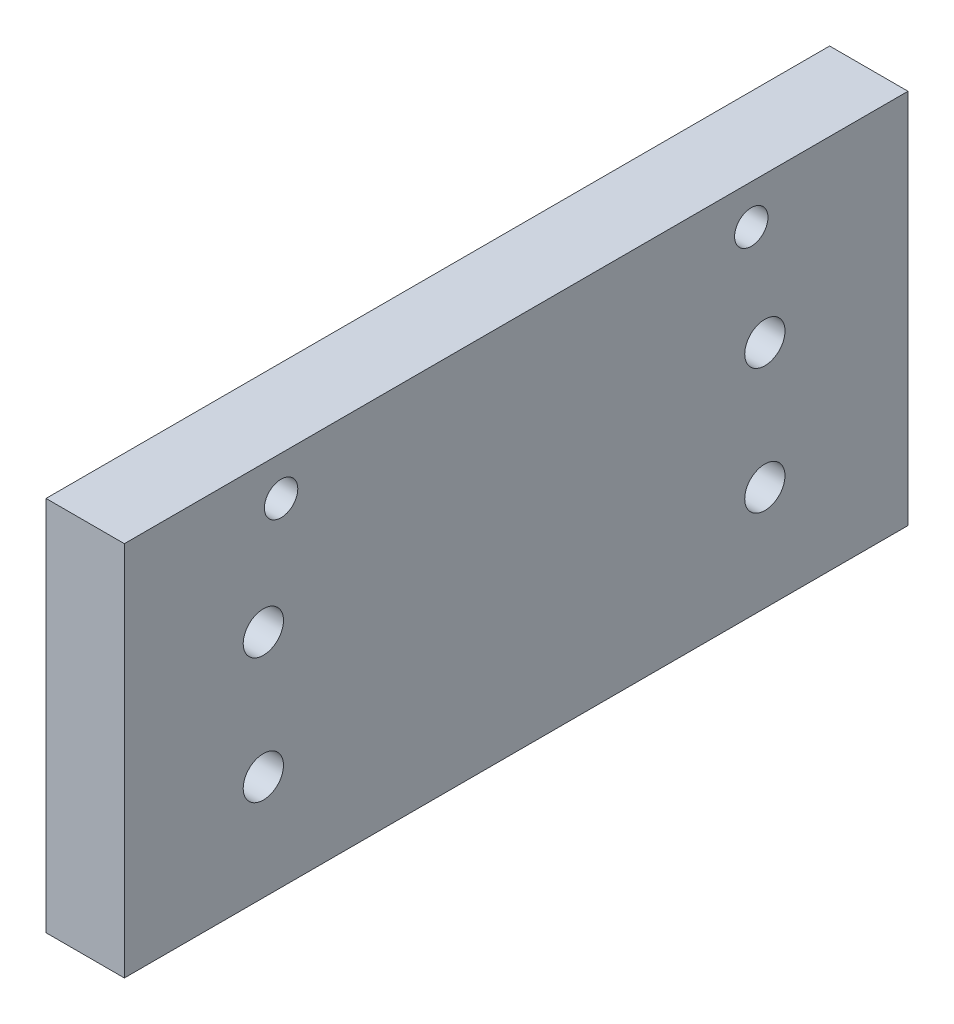
ISO-10303-21;
HEADER;
FILE_DESCRIPTION(('STEP AP214'),'2;1');
FILE_NAME('part.step','',(''),(''),'','','');
FILE_SCHEMA(('AUTOMOTIVE_DESIGN { 1 0 10303 214 1 1 1 1 }'));
ENDSEC;
DATA;
#1=APPLICATION_CONTEXT('core data for automotive mechanical design processes');
#2=APPLICATION_PROTOCOL_DEFINITION('international standard','automotive_design',2000,#1);
#3=PRODUCT_CONTEXT('',#1,'mechanical');
#4=PRODUCT('Part','Part','',(#3));
#5=PRODUCT_RELATED_PRODUCT_CATEGORY('part','',(#4));
#6=PRODUCT_DEFINITION_FORMATION('','',#4);
#7=PRODUCT_DEFINITION_CONTEXT('part definition',#1,'design');
#8=PRODUCT_DEFINITION('design','',#6,#7);
#9=PRODUCT_DEFINITION_SHAPE('','',#8);
#10=(LENGTH_UNIT() NAMED_UNIT(*) SI_UNIT(.MILLI.,.METRE.));
#11=(NAMED_UNIT(*) PLANE_ANGLE_UNIT() SI_UNIT($,.RADIAN.));
#12=(NAMED_UNIT(*) SI_UNIT($,.STERADIAN.) SOLID_ANGLE_UNIT());
#13=UNCERTAINTY_MEASURE_WITH_UNIT(LENGTH_MEASURE(1.E-05),#10,'distance_accuracy_value','');
#14=(GEOMETRIC_REPRESENTATION_CONTEXT(3) GLOBAL_UNCERTAINTY_ASSIGNED_CONTEXT((#13)) GLOBAL_UNIT_ASSIGNED_CONTEXT((#10,
#11,#12)) REPRESENTATION_CONTEXT('',''));
#15=CARTESIAN_POINT('',(0.,0.,0.));
#16=DIRECTION('',(0.,0.,1.));
#17=DIRECTION('',(1.,0.,0.));
#18=AXIS2_PLACEMENT_3D('',#15,#16,#17);
#19=CARTESIAN_POINT('',(0.,4.96112837408402,60.2648722985479));
#20=DIRECTION('',(1.,0.,0.));
#21=DIRECTION('',(0.,0.,-1.));
#22=AXIS2_PLACEMENT_3D('',#19,#20,#21);
#23=PLANE('',#22);
#24=CARTESIAN_POINT('',(0.,23.6086809904208,49.003470458459));
#25=DIRECTION('',(-1.,0.,0.));
#26=DIRECTION('',(0.,0.,1.));
#27=AXIS2_PLACEMENT_3D('',#24,#25,#26);
#28=CIRCLE('',#27,1.63194999999999);
#29=CARTESIAN_POINT('',(0.,23.6086809904208,50.635420458459));
#30=VERTEX_POINT('',#29);
#31=EDGE_CURVE('E218',#30,#30,#28,.T.);
#32=ORIENTED_EDGE('',*,*,#31,.F.);
#33=EDGE_LOOP('',(#32));
#34=FACE_BOUND('',#33,.T.);
#35=CARTESIAN_POINT('',(0.,23.6086809904208,8.36347045845898));
#36=DIRECTION('',(-1.,0.,0.));
#37=DIRECTION('',(0.,0.,1.));
#38=AXIS2_PLACEMENT_3D('',#35,#36,#37);
#39=CIRCLE('',#38,1.63194999999999);
#40=CARTESIAN_POINT('',(0.,23.6086809904208,9.99542045845897));
#41=VERTEX_POINT('',#40);
#42=EDGE_CURVE('E114',#41,#41,#39,.T.);
#43=ORIENTED_EDGE('',*,*,#42,.F.);
#44=EDGE_LOOP('',(#43));
#45=FACE_BOUND('',#44,.T.);
#46=CARTESIAN_POINT('',(0.,32.266128374084,47.5648722985479));
#47=DIRECTION('',(-1.,0.,0.));
#48=DIRECTION('',(0.,0.,1.));
#49=AXIS2_PLACEMENT_3D('',#46,#47,#48);
#50=CIRCLE('',#49,1.98755);
#51=CARTESIAN_POINT('',(0.,32.266128374084,49.5524222985479));
#52=VERTEX_POINT('',#51);
#53=EDGE_CURVE('E198',#52,#52,#50,.T.);
#54=ORIENTED_EDGE('',*,*,#53,.F.);
#55=EDGE_LOOP('',(#54));
#56=FACE_BOUND('',#55,.T.);
#57=DIRECTION('',(0.,-1.,0.));
#58=VECTOR('',#57,1.);
#59=CARTESIAN_POINT('',(0.,35.441128374084,60.2648722985479));
#60=LINE('',#59,#58);
#61=CARTESIAN_POINT('',(0.,35.441128374084,60.2648722985479));
#62=VERTEX_POINT('',#61);
#63=CARTESIAN_POINT('',(0.,4.96112837408402,60.2648722985479));
#64=VERTEX_POINT('',#63);
#65=EDGE_CURVE('E99',#62,#64,#60,.T.);
#66=ORIENTED_EDGE('',*,*,#65,.F.);
#67=DIRECTION('',(0.,0.,1.));
#68=VECTOR('',#67,1.);
#69=CARTESIAN_POINT('',(0.,35.441128374084,60.2648722985479));
#70=LINE('',#69,#68);
#71=CARTESIAN_POINT('',(0.,35.441128374084,-3.23512770145205));
#72=VERTEX_POINT('',#71);
#73=EDGE_CURVE('E70',#72,#62,#70,.T.);
#74=ORIENTED_EDGE('',*,*,#73,.F.);
#75=DIRECTION('',(0.,1.,0.));
#76=VECTOR('',#75,1.);
#77=CARTESIAN_POINT('',(0.,35.441128374084,-3.23512770145205));
#78=LINE('',#77,#76);
#79=CARTESIAN_POINT('',(0.,4.96112837408402,-3.23512770145207));
#80=VERTEX_POINT('',#79);
#81=EDGE_CURVE('E64',#80,#72,#78,.T.);
#82=ORIENTED_EDGE('',*,*,#81,.F.);
#83=DIRECTION('',(0.,0.,-1.));
#84=VECTOR('',#83,1.);
#85=CARTESIAN_POINT('',(0.,4.96112837408402,60.2648722985479));
#86=LINE('',#85,#84);
#87=EDGE_CURVE('E89',#64,#80,#86,.T.);
#88=ORIENTED_EDGE('',*,*,#87,.F.);
#89=EDGE_LOOP('',(#66,#74,#82,#88));
#90=FACE_BOUND('',#89,.T.);
#91=CARTESIAN_POINT('',(0.,32.266128374084,9.46487229854794));
#92=DIRECTION('',(-1.,0.,0.));
#93=DIRECTION('',(0.,0.,1.));
#94=AXIS2_PLACEMENT_3D('',#91,#92,#93);
#95=CIRCLE('',#94,1.98755);
#96=CARTESIAN_POINT('',(0.,32.266128374084,11.4524222985479));
#97=VERTEX_POINT('',#96);
#98=EDGE_CURVE('E113',#97,#97,#95,.T.);
#99=ORIENTED_EDGE('',*,*,#98,.F.);
#100=EDGE_LOOP('',(#99));
#101=FACE_BOUND('',#100,.T.);
#102=CARTESIAN_POINT('',(0.,13.4486809904208,8.36347045845897));
#103=DIRECTION('',(-1.,0.,0.));
#104=DIRECTION('',(0.,0.,1.));
#105=AXIS2_PLACEMENT_3D('',#102,#103,#104);
#106=CIRCLE('',#105,1.63194999999999);
#107=CARTESIAN_POINT('',(0.,13.4486809904208,9.99542045845896));
#108=VERTEX_POINT('',#107);
#109=EDGE_CURVE('E117',#108,#108,#106,.T.);
#110=ORIENTED_EDGE('',*,*,#109,.F.);
#111=EDGE_LOOP('',(#110));
#112=FACE_BOUND('',#111,.T.);
#113=CARTESIAN_POINT('',(0.,13.4486809904208,49.003470458459));
#114=DIRECTION('',(-1.,0.,0.));
#115=DIRECTION('',(0.,0.,1.));
#116=AXIS2_PLACEMENT_3D('',#113,#114,#115);
#117=CIRCLE('',#116,1.63194999999999);
#118=CARTESIAN_POINT('',(0.,13.4486809904208,50.635420458459));
#119=VERTEX_POINT('',#118);
#120=EDGE_CURVE('E11',#119,#119,#117,.T.);
#121=ORIENTED_EDGE('',*,*,#120,.F.);
#122=EDGE_LOOP('',(#121));
#123=FACE_BOUND('',#122,.T.);
#124=ADVANCED_FACE('F30',(#34,#45,#56,#90,#101,#112,#123),#23,.F.);
#125=CARTESIAN_POINT('',(6.35,35.441128374084,60.2648722985479));
#126=DIRECTION('',(0.,0.,-1.));
#127=DIRECTION('',(0.,1.,0.));
#128=AXIS2_PLACEMENT_3D('',#125,#126,#127);
#129=PLANE('',#128);
#130=ORIENTED_EDGE('',*,*,#65,.T.);
#131=DIRECTION('',(-1.,0.,0.));
#132=VECTOR('',#131,1.);
#133=CARTESIAN_POINT('',(6.35,4.96112837408402,60.2648722985479));
#134=LINE('',#133,#132);
#135=CARTESIAN_POINT('',(6.35,4.96112837408402,60.2648722985479));
#136=VERTEX_POINT('',#135);
#137=EDGE_CURVE('E90',#136,#64,#134,.T.);
#138=ORIENTED_EDGE('',*,*,#137,.F.);
#139=DIRECTION('',(0.,-1.,0.));
#140=VECTOR('',#139,1.);
#141=CARTESIAN_POINT('',(6.35,35.441128374084,60.2648722985479));
#142=LINE('',#141,#140);
#143=CARTESIAN_POINT('',(6.35,35.441128374084,60.2648722985479));
#144=VERTEX_POINT('',#143);
#145=EDGE_CURVE('E84',#144,#136,#142,.T.);
#146=ORIENTED_EDGE('',*,*,#145,.F.);
#147=DIRECTION('',(-1.,0.,0.));
#148=VECTOR('',#147,1.);
#149=CARTESIAN_POINT('',(6.35,35.441128374084,60.2648722985479));
#150=LINE('',#149,#148);
#151=EDGE_CURVE('E95',#144,#62,#150,.T.);
#152=ORIENTED_EDGE('',*,*,#151,.T.);
#153=EDGE_LOOP('',(#130,#138,#146,#152));
#154=FACE_BOUND('',#153,.T.);
#155=ADVANCED_FACE('F142',(#154),#129,.F.);
#156=CARTESIAN_POINT('',(6.35,4.96112837408402,60.2648722985479));
#157=DIRECTION('',(0.,1.,0.));
#158=DIRECTION('',(0.,0.,1.));
#159=AXIS2_PLACEMENT_3D('',#156,#157,#158);
#160=PLANE('',#159);
#161=ORIENTED_EDGE('',*,*,#87,.T.);
#162=DIRECTION('',(-1.,0.,0.));
#163=VECTOR('',#162,1.);
#164=CARTESIAN_POINT('',(6.35,4.96112837408402,-3.23512770145207));
#165=LINE('',#164,#163);
#166=CARTESIAN_POINT('',(6.35,4.96112837408402,-3.23512770145207));
#167=VERTEX_POINT('',#166);
#168=EDGE_CURVE('E87',#167,#80,#165,.T.);
#169=ORIENTED_EDGE('',*,*,#168,.F.);
#170=DIRECTION('',(0.,0.,-1.));
#171=VECTOR('',#170,1.);
#172=CARTESIAN_POINT('',(6.35,4.96112837408402,60.2648722985479));
#173=LINE('',#172,#171);
#174=EDGE_CURVE('E78',#136,#167,#173,.T.);
#175=ORIENTED_EDGE('',*,*,#174,.F.);
#176=ORIENTED_EDGE('',*,*,#137,.T.);
#177=EDGE_LOOP('',(#161,#169,#175,#176));
#178=FACE_BOUND('',#177,.T.);
#179=ADVANCED_FACE('F88',(#178),#160,.F.);
#180=CARTESIAN_POINT('',(6.35,35.441128374084,-3.23512770145205));
#181=DIRECTION('',(0.,0.,1.));
#182=DIRECTION('',(0.,-1.,0.));
#183=AXIS2_PLACEMENT_3D('',#180,#181,#182);
#184=PLANE('',#183);
#185=ORIENTED_EDGE('',*,*,#81,.T.);
#186=DIRECTION('',(-1.,0.,0.));
#187=VECTOR('',#186,1.);
#188=CARTESIAN_POINT('',(6.35,35.441128374084,-3.23512770145205));
#189=LINE('',#188,#187);
#190=CARTESIAN_POINT('',(6.35,35.441128374084,-3.23512770145205));
#191=VERTEX_POINT('',#190);
#192=EDGE_CURVE('E91',#191,#72,#189,.T.);
#193=ORIENTED_EDGE('',*,*,#192,.F.);
#194=DIRECTION('',(0.,1.,0.));
#195=VECTOR('',#194,1.);
#196=CARTESIAN_POINT('',(6.35,35.441128374084,-3.23512770145205));
#197=LINE('',#196,#195);
#198=EDGE_CURVE('E82',#167,#191,#197,.T.);
#199=ORIENTED_EDGE('',*,*,#198,.F.);
#200=ORIENTED_EDGE('',*,*,#168,.T.);
#201=EDGE_LOOP('',(#185,#193,#199,#200));
#202=FACE_BOUND('',#201,.T.);
#203=ADVANCED_FACE('F93',(#202),#184,.F.);
#204=CARTESIAN_POINT('',(6.35,35.441128374084,60.2648722985479));
#205=DIRECTION('',(0.,-1.,0.));
#206=DIRECTION('',(0.,0.,-1.));
#207=AXIS2_PLACEMENT_3D('',#204,#205,#206);
#208=PLANE('',#207);
#209=ORIENTED_EDGE('',*,*,#73,.T.);
#210=ORIENTED_EDGE('',*,*,#151,.F.);
#211=DIRECTION('',(0.,0.,1.));
#212=VECTOR('',#211,1.);
#213=CARTESIAN_POINT('',(6.35,35.441128374084,60.2648722985479));
#214=LINE('',#213,#212);
#215=EDGE_CURVE('E47',#191,#144,#214,.T.);
#216=ORIENTED_EDGE('',*,*,#215,.F.);
#217=ORIENTED_EDGE('',*,*,#192,.T.);
#218=EDGE_LOOP('',(#209,#210,#216,#217));
#219=FACE_BOUND('',#218,.T.);
#220=ADVANCED_FACE('F126',(#219),#208,.F.);
#221=CARTESIAN_POINT('',(6.35,4.96112837408402,60.2648722985479));
#222=DIRECTION('',(1.,0.,0.));
#223=DIRECTION('',(0.,0.,-1.));
#224=AXIS2_PLACEMENT_3D('',#221,#222,#223);
#225=PLANE('',#224);
#226=CARTESIAN_POINT('',(6.35,23.6086809904208,49.003470458459));
#227=DIRECTION('',(1.,0.,0.));
#228=DIRECTION('',(0.,0.,-1.));
#229=AXIS2_PLACEMENT_3D('',#226,#227,#228);
#230=CIRCLE('',#229,1.63194999999999);
#231=CARTESIAN_POINT('',(6.35,23.6086809904208,47.371520458459));
#232=VERTEX_POINT('',#231);
#233=EDGE_CURVE('E221',#232,#232,#230,.T.);
#234=ORIENTED_EDGE('',*,*,#233,.F.);
#235=EDGE_LOOP('',(#234));
#236=FACE_BOUND('',#235,.T.);
#237=CARTESIAN_POINT('',(6.35,23.6086809904208,8.36347045845898));
#238=DIRECTION('',(1.,0.,0.));
#239=DIRECTION('',(0.,0.,-1.));
#240=AXIS2_PLACEMENT_3D('',#237,#238,#239);
#241=CIRCLE('',#240,1.63194999999999);
#242=CARTESIAN_POINT('',(6.35,23.6086809904208,6.73152045845899));
#243=VERTEX_POINT('',#242);
#244=EDGE_CURVE('E110',#243,#243,#241,.T.);
#245=ORIENTED_EDGE('',*,*,#244,.F.);
#246=EDGE_LOOP('',(#245));
#247=FACE_BOUND('',#246,.T.);
#248=CARTESIAN_POINT('',(6.35,32.266128374084,9.46487229854794));
#249=DIRECTION('',(1.,0.,0.));
#250=DIRECTION('',(0.,0.,-1.));
#251=AXIS2_PLACEMENT_3D('',#248,#249,#250);
#252=CIRCLE('',#251,1.35255);
#253=CARTESIAN_POINT('',(6.35,32.266128374084,8.11232229854793));
#254=VERTEX_POINT('',#253);
#255=EDGE_CURVE('E200',#254,#254,#252,.T.);
#256=ORIENTED_EDGE('',*,*,#255,.F.);
#257=EDGE_LOOP('',(#256));
#258=FACE_BOUND('',#257,.T.);
#259=CARTESIAN_POINT('',(6.35,32.266128374084,47.5648722985479));
#260=DIRECTION('',(1.,0.,0.));
#261=DIRECTION('',(0.,0.,-1.));
#262=AXIS2_PLACEMENT_3D('',#259,#260,#261);
#263=CIRCLE('',#262,1.35255);
#264=CARTESIAN_POINT('',(6.35,32.266128374084,46.2123222985479));
#265=VERTEX_POINT('',#264);
#266=EDGE_CURVE('E102',#265,#265,#263,.T.);
#267=ORIENTED_EDGE('',*,*,#266,.F.);
#268=EDGE_LOOP('',(#267));
#269=FACE_BOUND('',#268,.T.);
#270=ORIENTED_EDGE('',*,*,#145,.T.);
#271=ORIENTED_EDGE('',*,*,#174,.T.);
#272=ORIENTED_EDGE('',*,*,#198,.T.);
#273=ORIENTED_EDGE('',*,*,#215,.T.);
#274=EDGE_LOOP('',(#270,#271,#272,#273));
#275=FACE_BOUND('',#274,.T.);
#276=CARTESIAN_POINT('',(6.35,13.4486809904208,8.36347045845897));
#277=DIRECTION('',(1.,0.,0.));
#278=DIRECTION('',(0.,0.,-1.));
#279=AXIS2_PLACEMENT_3D('',#276,#277,#278);
#280=CIRCLE('',#279,1.63194999999999);
#281=CARTESIAN_POINT('',(6.35,13.4486809904208,6.73152045845898));
#282=VERTEX_POINT('',#281);
#283=EDGE_CURVE('E109',#282,#282,#280,.T.);
#284=ORIENTED_EDGE('',*,*,#283,.F.);
#285=EDGE_LOOP('',(#284));
#286=FACE_BOUND('',#285,.T.);
#287=CARTESIAN_POINT('',(6.35,13.4486809904208,49.003470458459));
#288=DIRECTION('',(1.,0.,0.));
#289=DIRECTION('',(0.,0.,-1.));
#290=AXIS2_PLACEMENT_3D('',#287,#288,#289);
#291=CIRCLE('',#290,1.63194999999999);
#292=CARTESIAN_POINT('',(6.35,13.4486809904208,47.371520458459));
#293=VERTEX_POINT('',#292);
#294=EDGE_CURVE('E39',#293,#293,#291,.T.);
#295=ORIENTED_EDGE('',*,*,#294,.F.);
#296=EDGE_LOOP('',(#295));
#297=FACE_BOUND('',#296,.T.);
#298=ADVANCED_FACE('F79',(#236,#247,#258,#269,#275,#286,#297),#225,.T.);
#299=CARTESIAN_POINT('',(0.,32.266128374084,47.5648722985479));
#300=DIRECTION('',(-1.,0.,0.));
#301=DIRECTION('',(0.,0.,1.));
#302=AXIS2_PLACEMENT_3D('',#299,#300,#301);
#303=CYLINDRICAL_SURFACE('',#302,1.35255);
#304=CARTESIAN_POINT('',(0.635,32.266128374084,47.5648722985479));
#305=DIRECTION('',(-1.,0.,0.));
#306=DIRECTION('',(0.,0.,1.));
#307=AXIS2_PLACEMENT_3D('',#304,#305,#306);
#308=CIRCLE('',#307,1.35255);
#309=CARTESIAN_POINT('',(0.635,32.266128374084,48.9174222985479));
#310=VERTEX_POINT('',#309);
#311=EDGE_CURVE('E195',#310,#310,#308,.T.);
#312=ORIENTED_EDGE('',*,*,#311,.T.);
#313=EDGE_LOOP('',(#312));
#314=FACE_BOUND('',#313,.T.);
#315=ORIENTED_EDGE('',*,*,#266,.T.);
#316=EDGE_LOOP('',(#315));
#317=FACE_BOUND('',#316,.T.);
#318=ADVANCED_FACE('F125',(#314,#317),#303,.F.);
#319=CARTESIAN_POINT('',(0.,32.266128374084,47.5648722985479));
#320=DIRECTION('',(-1.,0.,0.));
#321=DIRECTION('',(0.,0.,1.));
#322=AXIS2_PLACEMENT_3D('',#319,#320,#321);
#323=CONICAL_SURFACE('',#322,1.98755,0.785398163397446);
#324=ORIENTED_EDGE('',*,*,#311,.F.);
#325=EDGE_LOOP('',(#324));
#326=FACE_BOUND('',#325,.T.);
#327=ORIENTED_EDGE('',*,*,#53,.T.);
#328=EDGE_LOOP('',(#327));
#329=FACE_BOUND('',#328,.T.);
#330=ADVANCED_FACE('F134',(#326,#329),#323,.F.);
#331=CARTESIAN_POINT('',(0.,32.266128374084,9.46487229854794));
#332=DIRECTION('',(-1.,0.,0.));
#333=DIRECTION('',(0.,0.,1.));
#334=AXIS2_PLACEMENT_3D('',#331,#332,#333);
#335=CYLINDRICAL_SURFACE('',#334,1.35255);
#336=CARTESIAN_POINT('',(0.635,32.266128374084,9.46487229854794));
#337=DIRECTION('',(-1.,0.,0.));
#338=DIRECTION('',(0.,0.,1.));
#339=AXIS2_PLACEMENT_3D('',#336,#337,#338);
#340=CIRCLE('',#339,1.35255);
#341=CARTESIAN_POINT('',(0.635,32.266128374084,10.8174222985479));
#342=VERTEX_POINT('',#341);
#343=EDGE_CURVE('E204',#342,#342,#340,.T.);
#344=ORIENTED_EDGE('',*,*,#343,.T.);
#345=EDGE_LOOP('',(#344));
#346=FACE_BOUND('',#345,.T.);
#347=ORIENTED_EDGE('',*,*,#255,.T.);
#348=EDGE_LOOP('',(#347));
#349=FACE_BOUND('',#348,.T.);
#350=ADVANCED_FACE('F183',(#346,#349),#335,.F.);
#351=CARTESIAN_POINT('',(0.,32.266128374084,9.46487229854794));
#352=DIRECTION('',(-1.,0.,0.));
#353=DIRECTION('',(0.,0.,1.));
#354=AXIS2_PLACEMENT_3D('',#351,#352,#353);
#355=CONICAL_SURFACE('',#354,1.98755,0.785398163397446);
#356=ORIENTED_EDGE('',*,*,#343,.F.);
#357=EDGE_LOOP('',(#356));
#358=FACE_BOUND('',#357,.T.);
#359=ORIENTED_EDGE('',*,*,#98,.T.);
#360=EDGE_LOOP('',(#359));
#361=FACE_BOUND('',#360,.T.);
#362=ADVANCED_FACE('F175',(#358,#361),#355,.F.);
#363=CARTESIAN_POINT('',(0.,23.6086809904208,8.36347045845898));
#364=DIRECTION('',(-1.,0.,0.));
#365=DIRECTION('',(0.,0.,1.));
#366=AXIS2_PLACEMENT_3D('',#363,#364,#365);
#367=CYLINDRICAL_SURFACE('',#366,1.63194999999999);
#368=ORIENTED_EDGE('',*,*,#244,.T.);
#369=EDGE_LOOP('',(#368));
#370=FACE_BOUND('',#369,.T.);
#371=ORIENTED_EDGE('',*,*,#42,.T.);
#372=EDGE_LOOP('',(#371));
#373=FACE_BOUND('',#372,.T.);
#374=ADVANCED_FACE('F164',(#370,#373),#367,.F.);
#375=CARTESIAN_POINT('',(0.,23.6086809904208,49.003470458459));
#376=DIRECTION('',(-1.,0.,0.));
#377=DIRECTION('',(0.,0.,1.));
#378=AXIS2_PLACEMENT_3D('',#375,#376,#377);
#379=CYLINDRICAL_SURFACE('',#378,1.63194999999999);
#380=ORIENTED_EDGE('',*,*,#233,.T.);
#381=EDGE_LOOP('',(#380));
#382=FACE_BOUND('',#381,.T.);
#383=ORIENTED_EDGE('',*,*,#31,.T.);
#384=EDGE_LOOP('',(#383));
#385=FACE_BOUND('',#384,.T.);
#386=ADVANCED_FACE('F158',(#382,#385),#379,.F.);
#387=CARTESIAN_POINT('',(0.,13.4486809904208,8.36347045845897));
#388=DIRECTION('',(-1.,0.,0.));
#389=DIRECTION('',(0.,0.,1.));
#390=AXIS2_PLACEMENT_3D('',#387,#388,#389);
#391=CYLINDRICAL_SURFACE('',#390,1.63194999999999);
#392=ORIENTED_EDGE('',*,*,#283,.T.);
#393=EDGE_LOOP('',(#392));
#394=FACE_BOUND('',#393,.T.);
#395=ORIENTED_EDGE('',*,*,#109,.T.);
#396=EDGE_LOOP('',(#395));
#397=FACE_BOUND('',#396,.T.);
#398=ADVANCED_FACE('F156',(#394,#397),#391,.F.);
#399=CARTESIAN_POINT('',(0.,13.4486809904208,49.003470458459));
#400=DIRECTION('',(-1.,0.,0.));
#401=DIRECTION('',(0.,0.,1.));
#402=AXIS2_PLACEMENT_3D('',#399,#400,#401);
#403=CYLINDRICAL_SURFACE('',#402,1.63194999999999);
#404=ORIENTED_EDGE('',*,*,#294,.T.);
#405=EDGE_LOOP('',(#404));
#406=FACE_BOUND('',#405,.T.);
#407=ORIENTED_EDGE('',*,*,#120,.T.);
#408=EDGE_LOOP('',(#407));
#409=FACE_BOUND('',#408,.T.);
#410=ADVANCED_FACE('F32',(#406,#409),#403,.F.);
#411=CLOSED_SHELL('',(#124,#155,#179,#203,#220,#298,#318,#330,#350,#362,#374,#386,#398,#410));
#412=MANIFOLD_SOLID_BREP('B2',#411);
#413=ADVANCED_BREP_SHAPE_REPRESENTATION('',(#18,#412),#14);
#414=SHAPE_DEFINITION_REPRESENTATION(#9,#413);
ENDSEC;
END-ISO-10303-21;
